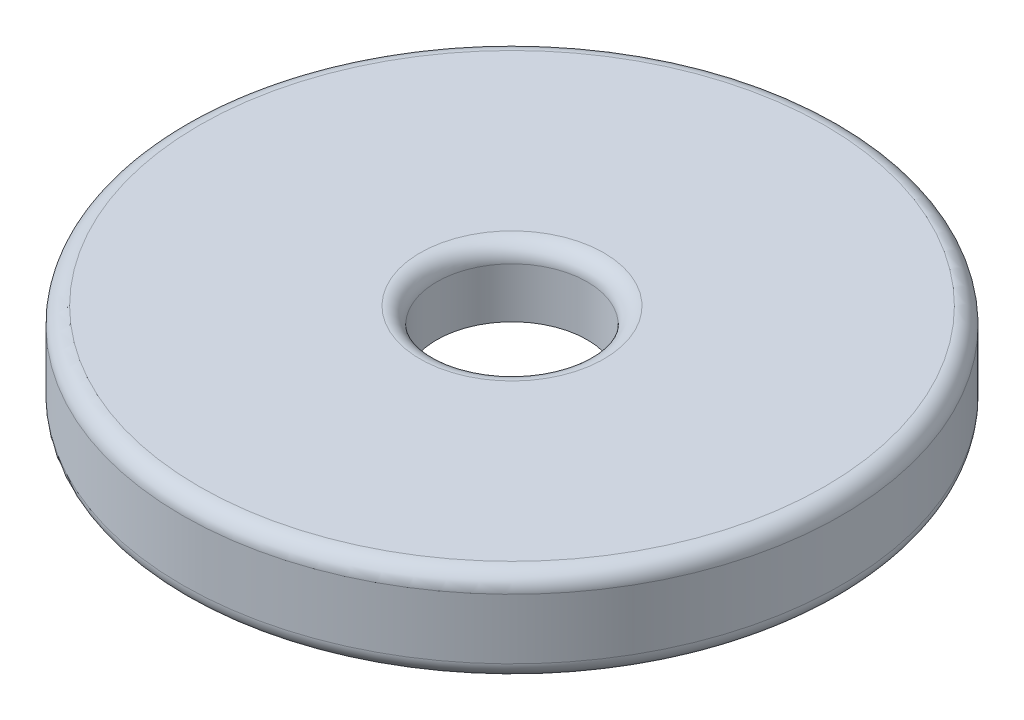
ISO-10303-21;
HEADER;
FILE_DESCRIPTION(('STEP AP214'),'2;1');
FILE_NAME('part.step','',(''),(''),'','','');
FILE_SCHEMA(('AUTOMOTIVE_DESIGN { 1 0 10303 214 1 1 1 1 }'));
ENDSEC;
DATA;
#1=APPLICATION_CONTEXT('core data for automotive mechanical design processes');
#2=APPLICATION_PROTOCOL_DEFINITION('international standard','automotive_design',2000,#1);
#3=PRODUCT_CONTEXT('',#1,'mechanical');
#4=PRODUCT('Part','Part','',(#3));
#5=PRODUCT_RELATED_PRODUCT_CATEGORY('part','',(#4));
#6=PRODUCT_DEFINITION_FORMATION('','',#4);
#7=PRODUCT_DEFINITION_CONTEXT('part definition',#1,'design');
#8=PRODUCT_DEFINITION('design','',#6,#7);
#9=PRODUCT_DEFINITION_SHAPE('','',#8);
#10=(LENGTH_UNIT() NAMED_UNIT(*) SI_UNIT(.MILLI.,.METRE.));
#11=(NAMED_UNIT(*) PLANE_ANGLE_UNIT() SI_UNIT($,.RADIAN.));
#12=(NAMED_UNIT(*) SI_UNIT($,.STERADIAN.) SOLID_ANGLE_UNIT());
#13=UNCERTAINTY_MEASURE_WITH_UNIT(LENGTH_MEASURE(1.E-05),#10,'distance_accuracy_value','');
#14=(GEOMETRIC_REPRESENTATION_CONTEXT(3) GLOBAL_UNCERTAINTY_ASSIGNED_CONTEXT((#13)) GLOBAL_UNIT_ASSIGNED_CONTEXT((#10,
#11,#12)) REPRESENTATION_CONTEXT('',''));
#15=CARTESIAN_POINT('',(0.,0.,0.));
#16=DIRECTION('',(0.,0.,1.));
#17=DIRECTION('',(1.,0.,0.));
#18=AXIS2_PLACEMENT_3D('',#15,#16,#17);
#19=CARTESIAN_POINT('',(-8.3479,0.,0.));
#20=DIRECTION('',(0.,1.,0.));
#21=DIRECTION('',(0.,0.,1.));
#22=AXIS2_PLACEMENT_3D('',#19,#20,#21);
#23=PLANE('',#22);
#24=CARTESIAN_POINT('',(0.,0.,0.));
#25=DIRECTION('',(0.,-1.,0.));
#26=DIRECTION('',(0.,0.,-1.));
#27=AXIS2_PLACEMENT_3D('',#24,#25,#26);
#28=CIRCLE('',#27,2.2479);
#29=CARTESIAN_POINT('',(0.,0.,-2.2479));
#30=VERTEX_POINT('',#29);
#31=EDGE_CURVE('E83',#30,#30,#28,.T.);
#32=ORIENTED_EDGE('',*,*,#31,.F.);
#33=EDGE_LOOP('',(#32));
#34=FACE_BOUND('',#33,.T.);
#35=CARTESIAN_POINT('',(0.,0.,0.));
#36=DIRECTION('',(0.,-1.,0.));
#37=DIRECTION('',(0.,0.,-1.));
#38=AXIS2_PLACEMENT_3D('',#35,#36,#37);
#39=CIRCLE('',#38,8.3479);
#40=CARTESIAN_POINT('',(0.,0.,-8.3479));
#41=VERTEX_POINT('',#40);
#42=EDGE_CURVE('E87',#41,#41,#39,.T.);
#43=ORIENTED_EDGE('',*,*,#42,.T.);
#44=EDGE_LOOP('',(#43));
#45=FACE_BOUND('',#44,.T.);
#46=ADVANCED_FACE('F43',(#34,#45),#23,.F.);
#47=CARTESIAN_POINT('',(0.,0.,0.));
#48=DIRECTION('',(0.,-1.,0.));
#49=DIRECTION('',(0.,0.,-1.));
#50=AXIS2_PLACEMENT_3D('',#47,#48,#49);
#51=CYLINDRICAL_SURFACE('',#50,2.2479);
#52=CARTESIAN_POINT('',(0.,1.5,0.));
#53=DIRECTION('',(0.,-1.,0.));
#54=DIRECTION('',(0.,0.,-1.));
#55=AXIS2_PLACEMENT_3D('',#52,#53,#54);
#56=CIRCLE('',#55,2.2479);
#57=CARTESIAN_POINT('',(0.,1.5,-2.2479));
#58=VERTEX_POINT('',#57);
#59=EDGE_CURVE('E61',#58,#58,#56,.F.);
#60=ORIENTED_EDGE('',*,*,#59,.T.);
#61=EDGE_LOOP('',(#60));
#62=FACE_BOUND('',#61,.T.);
#63=ORIENTED_EDGE('',*,*,#31,.T.);
#64=EDGE_LOOP('',(#63));
#65=FACE_BOUND('',#64,.T.);
#66=ADVANCED_FACE('F108',(#62,#65),#51,.F.);
#67=CARTESIAN_POINT('',(-2.2479,2.,0.));
#68=DIRECTION('',(0.,-1.,0.));
#69=DIRECTION('',(0.,0.,-1.));
#70=AXIS2_PLACEMENT_3D('',#67,#68,#69);
#71=PLANE('',#70);
#72=CARTESIAN_POINT('',(0.,2.,0.));
#73=DIRECTION('',(0.,-1.,0.));
#74=DIRECTION('',(0.,0.,-1.));
#75=AXIS2_PLACEMENT_3D('',#72,#73,#74);
#76=CIRCLE('',#75,9.3479);
#77=CARTESIAN_POINT('',(0.,2.,-9.3479));
#78=VERTEX_POINT('',#77);
#79=EDGE_CURVE('E67',#78,#78,#76,.F.);
#80=ORIENTED_EDGE('',*,*,#79,.T.);
#81=EDGE_LOOP('',(#80));
#82=FACE_BOUND('',#81,.T.);
#83=CARTESIAN_POINT('',(0.,2.,0.));
#84=DIRECTION('',(0.,-1.,0.));
#85=DIRECTION('',(0.,0.,-1.));
#86=AXIS2_PLACEMENT_3D('',#83,#84,#85);
#87=CIRCLE('',#86,2.7479);
#88=CARTESIAN_POINT('',(0.,2.,-2.7479));
#89=VERTEX_POINT('',#88);
#90=EDGE_CURVE('E71',#89,#89,#87,.T.);
#91=ORIENTED_EDGE('',*,*,#90,.T.);
#92=EDGE_LOOP('',(#91));
#93=FACE_BOUND('',#92,.T.);
#94=ADVANCED_FACE('F114',(#82,#93),#71,.F.);
#95=CARTESIAN_POINT('',(0.,0.,0.));
#96=DIRECTION('',(0.,-1.,0.));
#97=DIRECTION('',(0.,0.,-1.));
#98=AXIS2_PLACEMENT_3D('',#95,#96,#97);
#99=CYLINDRICAL_SURFACE('',#98,9.8479);
#100=CARTESIAN_POINT('',(0.,1.5,0.));
#101=DIRECTION('',(0.,-1.,0.));
#102=DIRECTION('',(0.,0.,-1.));
#103=AXIS2_PLACEMENT_3D('',#100,#101,#102);
#104=CIRCLE('',#103,9.8479);
#105=CARTESIAN_POINT('',(0.,1.5,-9.8479));
#106=VERTEX_POINT('',#105);
#107=EDGE_CURVE('E75',#106,#106,#104,.T.);
#108=ORIENTED_EDGE('',*,*,#107,.T.);
#109=EDGE_LOOP('',(#108));
#110=FACE_BOUND('',#109,.T.);
#111=CARTESIAN_POINT('',(0.,-0.300000000000001,0.));
#112=DIRECTION('',(0.,1.,0.));
#113=DIRECTION('',(0.,0.,1.));
#114=AXIS2_PLACEMENT_3D('',#111,#112,#113);
#115=CIRCLE('',#114,9.8479);
#116=CARTESIAN_POINT('',(0.,-0.300000000000001,9.8479));
#117=VERTEX_POINT('',#116);
#118=EDGE_CURVE('E79',#117,#117,#115,.T.);
#119=ORIENTED_EDGE('',*,*,#118,.T.);
#120=EDGE_LOOP('',(#119));
#121=FACE_BOUND('',#120,.T.);
#122=ADVANCED_FACE('F105',(#110,#121),#99,.T.);
#123=CARTESIAN_POINT('',(-9.8479,-0.800000000000001,0.));
#124=DIRECTION('',(0.,1.,0.));
#125=DIRECTION('',(0.,0.,1.));
#126=AXIS2_PLACEMENT_3D('',#123,#124,#125);
#127=PLANE('',#126);
#128=CARTESIAN_POINT('',(0.,-0.800000000000001,0.));
#129=DIRECTION('',(0.,1.,0.));
#130=DIRECTION('',(0.,0.,1.));
#131=AXIS2_PLACEMENT_3D('',#128,#129,#130);
#132=CIRCLE('',#131,9.3479);
#133=CARTESIAN_POINT('',(0.,-0.800000000000001,9.3479));
#134=VERTEX_POINT('',#133);
#135=EDGE_CURVE('E51',#134,#134,#132,.F.);
#136=ORIENTED_EDGE('',*,*,#135,.T.);
#137=EDGE_LOOP('',(#136));
#138=FACE_BOUND('',#137,.T.);
#139=CARTESIAN_POINT('',(0.,-0.800000000000001,0.));
#140=DIRECTION('',(0.,1.,0.));
#141=DIRECTION('',(0.,0.,1.));
#142=AXIS2_PLACEMENT_3D('',#139,#140,#141);
#143=CIRCLE('',#142,8.8479);
#144=CARTESIAN_POINT('',(0.,-0.800000000000001,8.8479));
#145=VERTEX_POINT('',#144);
#146=EDGE_CURVE('E56',#145,#145,#143,.T.);
#147=ORIENTED_EDGE('',*,*,#146,.T.);
#148=EDGE_LOOP('',(#147));
#149=FACE_BOUND('',#148,.T.);
#150=ADVANCED_FACE('F96',(#138,#149),#127,.F.);
#151=CARTESIAN_POINT('',(0.,0.,0.));
#152=DIRECTION('',(0.,-1.,0.));
#153=DIRECTION('',(0.,0.,-1.));
#154=AXIS2_PLACEMENT_3D('',#151,#152,#153);
#155=CYLINDRICAL_SURFACE('',#154,8.3479);
#156=CARTESIAN_POINT('',(0.,-0.300000000000001,0.));
#157=DIRECTION('',(0.,1.,0.));
#158=DIRECTION('',(0.,0.,1.));
#159=AXIS2_PLACEMENT_3D('',#156,#157,#158);
#160=CIRCLE('',#159,8.3479);
#161=CARTESIAN_POINT('',(0.,-0.300000000000001,8.3479));
#162=VERTEX_POINT('',#161);
#163=EDGE_CURVE('E10',#162,#162,#160,.F.);
#164=ORIENTED_EDGE('',*,*,#163,.T.);
#165=EDGE_LOOP('',(#164));
#166=FACE_BOUND('',#165,.T.);
#167=ORIENTED_EDGE('',*,*,#42,.F.);
#168=EDGE_LOOP('',(#167));
#169=FACE_BOUND('',#168,.T.);
#170=ADVANCED_FACE('F93',(#166,#169),#155,.F.);
#171=CARTESIAN_POINT('',(0.,1.5,0.));
#172=DIRECTION('',(0.,-1.,0.));
#173=DIRECTION('',(0.,0.,-1.));
#174=AXIS2_PLACEMENT_3D('',#171,#172,#173);
#175=TOROIDAL_SURFACE('',#174,9.3479,0.5);
#176=ORIENTED_EDGE('',*,*,#79,.F.);
#177=EDGE_LOOP('',(#176));
#178=FACE_BOUND('',#177,.T.);
#179=ORIENTED_EDGE('',*,*,#107,.F.);
#180=EDGE_LOOP('',(#179));
#181=FACE_BOUND('',#180,.T.);
#182=ADVANCED_FACE('F95',(#178,#181),#175,.T.);
#183=CARTESIAN_POINT('',(0.,1.5,0.));
#184=DIRECTION('',(0.,-1.,0.));
#185=DIRECTION('',(0.,0.,-1.));
#186=AXIS2_PLACEMENT_3D('',#183,#184,#185);
#187=TOROIDAL_SURFACE('',#186,2.7479,0.5);
#188=ORIENTED_EDGE('',*,*,#59,.F.);
#189=EDGE_LOOP('',(#188));
#190=FACE_BOUND('',#189,.T.);
#191=ORIENTED_EDGE('',*,*,#90,.F.);
#192=EDGE_LOOP('',(#191));
#193=FACE_BOUND('',#192,.T.);
#194=ADVANCED_FACE('F102',(#190,#193),#187,.T.);
#195=CARTESIAN_POINT('',(0.,-0.300000000000001,0.));
#196=DIRECTION('',(0.,1.,0.));
#197=DIRECTION('',(0.,0.,1.));
#198=AXIS2_PLACEMENT_3D('',#195,#196,#197);
#199=TOROIDAL_SURFACE('',#198,9.3479,0.5);
#200=ORIENTED_EDGE('',*,*,#118,.F.);
#201=EDGE_LOOP('',(#200));
#202=FACE_BOUND('',#201,.T.);
#203=ORIENTED_EDGE('',*,*,#135,.F.);
#204=EDGE_LOOP('',(#203));
#205=FACE_BOUND('',#204,.T.);
#206=ADVANCED_FACE('F121',(#202,#205),#199,.T.);
#207=CARTESIAN_POINT('',(0.,-0.300000000000001,0.));
#208=DIRECTION('',(0.,1.,0.));
#209=DIRECTION('',(0.,0.,1.));
#210=AXIS2_PLACEMENT_3D('',#207,#208,#209);
#211=TOROIDAL_SURFACE('',#210,8.8479,0.5);
#212=ORIENTED_EDGE('',*,*,#146,.F.);
#213=EDGE_LOOP('',(#212));
#214=FACE_BOUND('',#213,.T.);
#215=ORIENTED_EDGE('',*,*,#163,.F.);
#216=EDGE_LOOP('',(#215));
#217=FACE_BOUND('',#216,.T.);
#218=ADVANCED_FACE('F45',(#214,#217),#211,.T.);
#219=CLOSED_SHELL('',(#46,#66,#94,#122,#150,#170,#182,#194,#206,#218));
#220=MANIFOLD_SOLID_BREP('B2',#219);
#221=ADVANCED_BREP_SHAPE_REPRESENTATION('',(#18,#220),#14);
#222=SHAPE_DEFINITION_REPRESENTATION(#9,#221);
ENDSEC;
END-ISO-10303-21;
